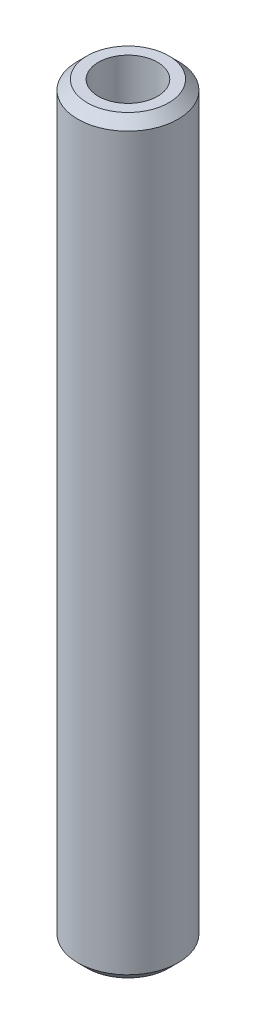
ISO-10303-21;
HEADER;
FILE_DESCRIPTION(('STEP AP214'),'2;1');
FILE_NAME('part.step','',(''),(''),'','','');
FILE_SCHEMA(('AUTOMOTIVE_DESIGN { 1 0 10303 214 1 1 1 1 }'));
ENDSEC;
DATA;
#1=APPLICATION_CONTEXT('core data for automotive mechanical design processes');
#2=APPLICATION_PROTOCOL_DEFINITION('international standard','automotive_design',2000,#1);
#3=PRODUCT_CONTEXT('',#1,'mechanical');
#4=PRODUCT('Part','Part','',(#3));
#5=PRODUCT_RELATED_PRODUCT_CATEGORY('part','',(#4));
#6=PRODUCT_DEFINITION_FORMATION('','',#4);
#7=PRODUCT_DEFINITION_CONTEXT('part definition',#1,'design');
#8=PRODUCT_DEFINITION('design','',#6,#7);
#9=PRODUCT_DEFINITION_SHAPE('','',#8);
#10=(LENGTH_UNIT() NAMED_UNIT(*) SI_UNIT(.MILLI.,.METRE.));
#11=(NAMED_UNIT(*) PLANE_ANGLE_UNIT() SI_UNIT($,.RADIAN.));
#12=(NAMED_UNIT(*) SI_UNIT($,.STERADIAN.) SOLID_ANGLE_UNIT());
#13=UNCERTAINTY_MEASURE_WITH_UNIT(LENGTH_MEASURE(1.E-05),#10,'distance_accuracy_value','');
#14=(GEOMETRIC_REPRESENTATION_CONTEXT(3) GLOBAL_UNCERTAINTY_ASSIGNED_CONTEXT((#13)) GLOBAL_UNIT_ASSIGNED_CONTEXT((#10,
#11,#12)) REPRESENTATION_CONTEXT('',''));
#15=CARTESIAN_POINT('',(0.,0.,0.));
#16=DIRECTION('',(0.,0.,1.));
#17=DIRECTION('',(1.,0.,0.));
#18=AXIS2_PLACEMENT_3D('',#15,#16,#17);
#19=CARTESIAN_POINT('',(0.,186.59230254854,0.));
#20=DIRECTION('',(0.,-1.,0.));
#21=DIRECTION('',(0.,0.,-1.));
#22=AXIS2_PLACEMENT_3D('',#19,#20,#21);
#23=CYLINDRICAL_SURFACE('',#22,12.5);
#24=CARTESIAN_POINT('',(0.,184.235004344136,0.));
#25=DIRECTION('',(0.,1.,0.));
#26=DIRECTION('',(0.,0.,1.));
#27=AXIS2_PLACEMENT_3D('',#24,#25,#26);
#28=CIRCLE('',#27,12.5);
#29=CARTESIAN_POINT('',(0.,184.235004344136,12.5));
#30=VERTEX_POINT('',#29);
#31=EDGE_CURVE('E50',#30,#30,#28,.F.);
#32=ORIENTED_EDGE('',*,*,#31,.T.);
#33=EDGE_LOOP('',(#32));
#34=FACE_BOUND('',#33,.T.);
#35=CARTESIAN_POINT('',(0.,2.35729820440353,0.));
#36=DIRECTION('',(0.,1.,0.));
#37=DIRECTION('',(0.,0.,1.));
#38=AXIS2_PLACEMENT_3D('',#35,#36,#37);
#39=CIRCLE('',#38,12.5);
#40=CARTESIAN_POINT('',(0.,2.35729820440353,12.5));
#41=VERTEX_POINT('',#40);
#42=EDGE_CURVE('E51',#41,#41,#39,.T.);
#43=ORIENTED_EDGE('',*,*,#42,.T.);
#44=EDGE_LOOP('',(#43));
#45=FACE_BOUND('',#44,.T.);
#46=ADVANCED_FACE('F39',(#34,#45),#23,.T.);
#47=CARTESIAN_POINT('',(0.,186.59230254854,0.));
#48=DIRECTION('',(0.,1.,0.));
#49=DIRECTION('',(0.,0.,1.));
#50=AXIS2_PLACEMENT_3D('',#47,#48,#49);
#51=PLANE('',#50);
#52=CARTESIAN_POINT('',(0.,186.59230254854,0.));
#53=DIRECTION('',(0.,1.,0.));
#54=DIRECTION('',(0.,0.,1.));
#55=AXIS2_PLACEMENT_3D('',#52,#53,#54);
#56=CIRCLE('',#55,10.1427017955964);
#57=CARTESIAN_POINT('',(0.,186.59230254854,10.1427017955964));
#58=VERTEX_POINT('',#57);
#59=EDGE_CURVE('E54',#58,#58,#56,.T.);
#60=ORIENTED_EDGE('',*,*,#59,.T.);
#61=EDGE_LOOP('',(#60));
#62=FACE_BOUND('',#61,.T.);
#63=CARTESIAN_POINT('',(0.,186.59230254854,0.));
#64=DIRECTION('',(0.,1.,0.));
#65=DIRECTION('',(0.,0.,1.));
#66=AXIS2_PLACEMENT_3D('',#63,#64,#65);
#67=CIRCLE('',#66,7.36436950404993);
#68=CARTESIAN_POINT('',(0.,186.59230254854,7.36436950404993));
#69=VERTEX_POINT('',#68);
#70=EDGE_CURVE('E58',#69,#69,#67,.T.);
#71=ORIENTED_EDGE('',*,*,#70,.F.);
#72=EDGE_LOOP('',(#71));
#73=FACE_BOUND('',#72,.T.);
#74=ADVANCED_FACE('F69',(#62,#73),#51,.T.);
#75=CARTESIAN_POINT('',(0.,0.,0.));
#76=DIRECTION('',(0.,1.,0.));
#77=DIRECTION('',(0.,0.,1.));
#78=AXIS2_PLACEMENT_3D('',#75,#76,#77);
#79=PLANE('',#78);
#80=CARTESIAN_POINT('',(0.,0.,0.));
#81=DIRECTION('',(0.,1.,0.));
#82=DIRECTION('',(0.,0.,1.));
#83=AXIS2_PLACEMENT_3D('',#80,#81,#82);
#84=CIRCLE('',#83,10.1427017955964);
#85=CARTESIAN_POINT('',(0.,0.,10.1427017955964));
#86=VERTEX_POINT('',#85);
#87=EDGE_CURVE('E10',#86,#86,#84,.F.);
#88=ORIENTED_EDGE('',*,*,#87,.T.);
#89=EDGE_LOOP('',(#88));
#90=FACE_BOUND('',#89,.T.);
#91=CARTESIAN_POINT('',(0.,0.,0.));
#92=DIRECTION('',(0.,1.,0.));
#93=DIRECTION('',(0.,0.,1.));
#94=AXIS2_PLACEMENT_3D('',#91,#92,#93);
#95=CIRCLE('',#94,7.36436950404993);
#96=CARTESIAN_POINT('',(0.,0.,7.36436950404993));
#97=VERTEX_POINT('',#96);
#98=EDGE_CURVE('E63',#97,#97,#95,.T.);
#99=ORIENTED_EDGE('',*,*,#98,.T.);
#100=EDGE_LOOP('',(#99));
#101=FACE_BOUND('',#100,.T.);
#102=ADVANCED_FACE('F75',(#90,#101),#79,.F.);
#103=CARTESIAN_POINT('',(0.,186.59230254854,0.));
#104=DIRECTION('',(0.,-1.,0.));
#105=DIRECTION('',(0.,0.,-1.));
#106=AXIS2_PLACEMENT_3D('',#103,#104,#105);
#107=CYLINDRICAL_SURFACE('',#106,7.36436950404993);
#108=ORIENTED_EDGE('',*,*,#70,.T.);
#109=EDGE_LOOP('',(#108));
#110=FACE_BOUND('',#109,.T.);
#111=ORIENTED_EDGE('',*,*,#98,.F.);
#112=EDGE_LOOP('',(#111));
#113=FACE_BOUND('',#112,.T.);
#114=ADVANCED_FACE('F70',(#110,#113),#107,.F.);
#115=CARTESIAN_POINT('',(0.,186.59230254854,0.));
#116=DIRECTION('',(0.,-1.,0.));
#117=DIRECTION('',(0.,0.,-1.));
#118=AXIS2_PLACEMENT_3D('',#115,#116,#117);
#119=CONICAL_SURFACE('',#118,10.1427017955964,0.78539816339744);
#120=ORIENTED_EDGE('',*,*,#31,.F.);
#121=EDGE_LOOP('',(#120));
#122=FACE_BOUND('',#121,.T.);
#123=ORIENTED_EDGE('',*,*,#59,.F.);
#124=EDGE_LOOP('',(#123));
#125=FACE_BOUND('',#124,.T.);
#126=ADVANCED_FACE('F81',(#122,#125),#119,.T.);
#127=CARTESIAN_POINT('',(0.,2.35729820440353,0.));
#128=DIRECTION('',(0.,1.,0.));
#129=DIRECTION('',(0.,0.,1.));
#130=AXIS2_PLACEMENT_3D('',#127,#128,#129);
#131=CONICAL_SURFACE('',#130,12.5,0.785398163397457);
#132=ORIENTED_EDGE('',*,*,#87,.F.);
#133=EDGE_LOOP('',(#132));
#134=FACE_BOUND('',#133,.T.);
#135=ORIENTED_EDGE('',*,*,#42,.F.);
#136=EDGE_LOOP('',(#135));
#137=FACE_BOUND('',#136,.T.);
#138=ADVANCED_FACE('F45',(#134,#137),#131,.T.);
#139=CLOSED_SHELL('',(#46,#74,#102,#114,#126,#138));
#140=MANIFOLD_SOLID_BREP('B2',#139);
#141=ADVANCED_BREP_SHAPE_REPRESENTATION('',(#18,#140),#14);
#142=SHAPE_DEFINITION_REPRESENTATION(#9,#141);
ENDSEC;
END-ISO-10303-21;
